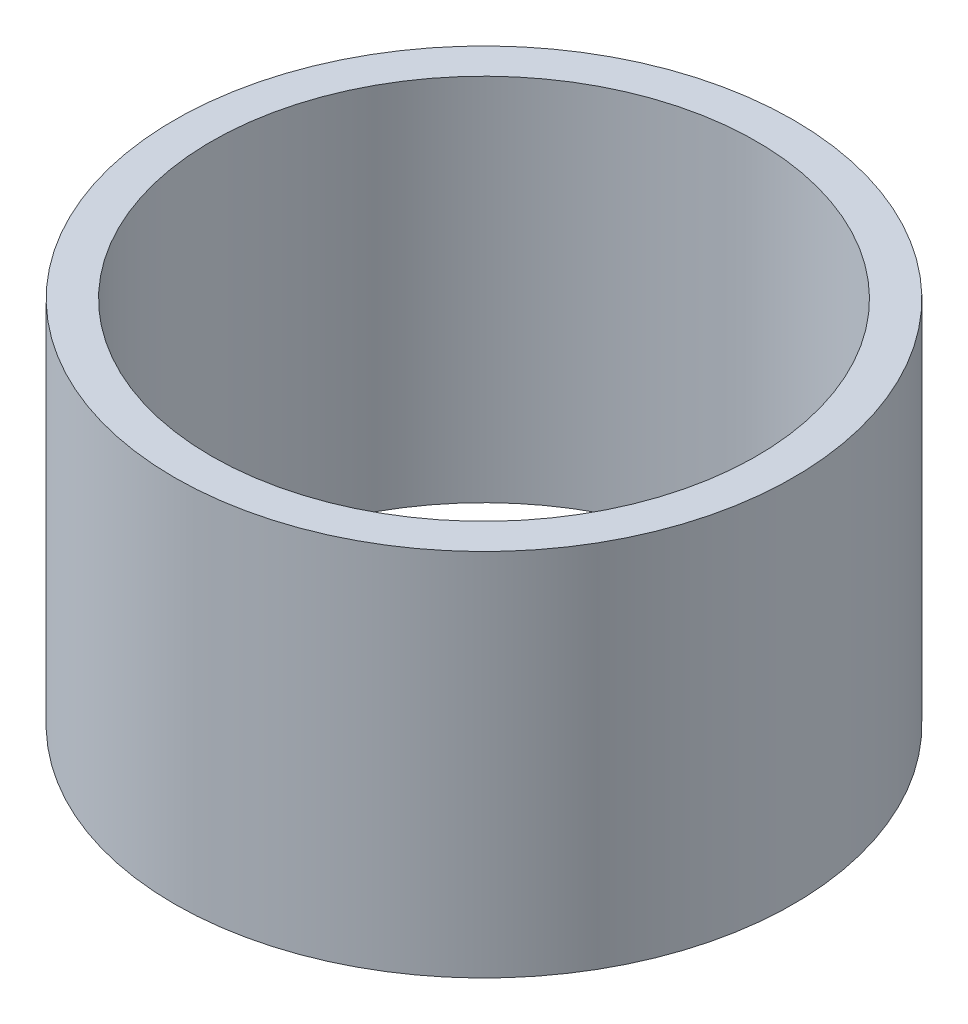
ISO-10303-21;
HEADER;
FILE_DESCRIPTION(('STEP AP214'),'2;1');
FILE_NAME('part.step','',(''),(''),'','','');
FILE_SCHEMA(('AUTOMOTIVE_DESIGN { 1 0 10303 214 1 1 1 1 }'));
ENDSEC;
DATA;
#1=APPLICATION_CONTEXT('core data for automotive mechanical design processes');
#2=APPLICATION_PROTOCOL_DEFINITION('international standard','automotive_design',2000,#1);
#3=PRODUCT_CONTEXT('',#1,'mechanical');
#4=PRODUCT('Part','Part','',(#3));
#5=PRODUCT_RELATED_PRODUCT_CATEGORY('part','',(#4));
#6=PRODUCT_DEFINITION_FORMATION('','',#4);
#7=PRODUCT_DEFINITION_CONTEXT('part definition',#1,'design');
#8=PRODUCT_DEFINITION('design','',#6,#7);
#9=PRODUCT_DEFINITION_SHAPE('','',#8);
#10=(LENGTH_UNIT() NAMED_UNIT(*) SI_UNIT(.MILLI.,.METRE.));
#11=(NAMED_UNIT(*) PLANE_ANGLE_UNIT() SI_UNIT($,.RADIAN.));
#12=(NAMED_UNIT(*) SI_UNIT($,.STERADIAN.) SOLID_ANGLE_UNIT());
#13=UNCERTAINTY_MEASURE_WITH_UNIT(LENGTH_MEASURE(1.E-05),#10,'distance_accuracy_value','');
#14=(GEOMETRIC_REPRESENTATION_CONTEXT(3) GLOBAL_UNCERTAINTY_ASSIGNED_CONTEXT((#13)) GLOBAL_UNIT_ASSIGNED_CONTEXT((#10,
#11,#12)) REPRESENTATION_CONTEXT('',''));
#15=CARTESIAN_POINT('',(0.,0.,0.));
#16=DIRECTION('',(0.,0.,1.));
#17=DIRECTION('',(1.,0.,0.));
#18=AXIS2_PLACEMENT_3D('',#15,#16,#17);
#19=CARTESIAN_POINT('',(0.,65.6178464032688,0.));
#20=DIRECTION('',(0.,-1.,0.));
#21=DIRECTION('',(0.,0.,-1.));
#22=AXIS2_PLACEMENT_3D('',#19,#20,#21);
#23=CYLINDRICAL_SURFACE('',#22,55.);
#24=CARTESIAN_POINT('',(0.,65.6178464032688,0.));
#25=DIRECTION('',(0.,1.,0.));
#26=DIRECTION('',(0.,0.,1.));
#27=AXIS2_PLACEMENT_3D('',#24,#25,#26);
#28=CIRCLE('',#27,55.);
#29=CARTESIAN_POINT('',(0.,65.6178464032688,55.));
#30=VERTEX_POINT('',#29);
#31=EDGE_CURVE('E10',#30,#30,#28,.T.);
#32=ORIENTED_EDGE('',*,*,#31,.F.);
#33=EDGE_LOOP('',(#32));
#34=FACE_BOUND('',#33,.T.);
#35=CARTESIAN_POINT('',(0.,0.,0.));
#36=DIRECTION('',(0.,1.,0.));
#37=DIRECTION('',(0.,0.,1.));
#38=AXIS2_PLACEMENT_3D('',#35,#36,#37);
#39=CIRCLE('',#38,55.);
#40=CARTESIAN_POINT('',(0.,0.,55.));
#41=VERTEX_POINT('',#40);
#42=EDGE_CURVE('E37',#41,#41,#39,.T.);
#43=ORIENTED_EDGE('',*,*,#42,.T.);
#44=EDGE_LOOP('',(#43));
#45=FACE_BOUND('',#44,.T.);
#46=ADVANCED_FACE('F40',(#34,#45),#23,.T.);
#47=CARTESIAN_POINT('',(0.,65.6178464032688,0.));
#48=DIRECTION('',(0.,1.,0.));
#49=DIRECTION('',(0.,0.,1.));
#50=AXIS2_PLACEMENT_3D('',#47,#48,#49);
#51=PLANE('',#50);
#52=CARTESIAN_POINT('',(0.,65.6178464032688,0.));
#53=DIRECTION('',(0.,1.,0.));
#54=DIRECTION('',(0.,0.,1.));
#55=AXIS2_PLACEMENT_3D('',#52,#53,#54);
#56=CIRCLE('',#55,48.4254078750892);
#57=CARTESIAN_POINT('',(0.,65.6178464032688,48.4254078750892));
#58=VERTEX_POINT('',#57);
#59=EDGE_CURVE('E50',#58,#58,#56,.T.);
#60=ORIENTED_EDGE('',*,*,#59,.F.);
#61=EDGE_LOOP('',(#60));
#62=FACE_BOUND('',#61,.T.);
#63=ORIENTED_EDGE('',*,*,#31,.T.);
#64=EDGE_LOOP('',(#63));
#65=FACE_BOUND('',#64,.T.);
#66=ADVANCED_FACE('F59',(#62,#65),#51,.T.);
#67=CARTESIAN_POINT('',(0.,0.,0.));
#68=DIRECTION('',(0.,1.,0.));
#69=DIRECTION('',(0.,0.,1.));
#70=AXIS2_PLACEMENT_3D('',#67,#68,#69);
#71=PLANE('',#70);
#72=CARTESIAN_POINT('',(0.,0.,0.));
#73=DIRECTION('',(0.,1.,0.));
#74=DIRECTION('',(0.,0.,1.));
#75=AXIS2_PLACEMENT_3D('',#72,#73,#74);
#76=CIRCLE('',#75,48.4254078750892);
#77=CARTESIAN_POINT('',(0.,0.,48.4254078750892));
#78=VERTEX_POINT('',#77);
#79=EDGE_CURVE('E47',#78,#78,#76,.T.);
#80=ORIENTED_EDGE('',*,*,#79,.T.);
#81=EDGE_LOOP('',(#80));
#82=FACE_BOUND('',#81,.T.);
#83=ORIENTED_EDGE('',*,*,#42,.F.);
#84=EDGE_LOOP('',(#83));
#85=FACE_BOUND('',#84,.T.);
#86=ADVANCED_FACE('F58',(#82,#85),#71,.F.);
#87=CARTESIAN_POINT('',(0.,65.6178464032688,0.));
#88=DIRECTION('',(0.,-1.,0.));
#89=DIRECTION('',(0.,0.,-1.));
#90=AXIS2_PLACEMENT_3D('',#87,#88,#89);
#91=CYLINDRICAL_SURFACE('',#90,48.4254078750892);
#92=ORIENTED_EDGE('',*,*,#59,.T.);
#93=EDGE_LOOP('',(#92));
#94=FACE_BOUND('',#93,.T.);
#95=ORIENTED_EDGE('',*,*,#79,.F.);
#96=EDGE_LOOP('',(#95));
#97=FACE_BOUND('',#96,.T.);
#98=ADVANCED_FACE('F54',(#94,#97),#91,.F.);
#99=CLOSED_SHELL('',(#46,#66,#86,#98));
#100=MANIFOLD_SOLID_BREP('B2',#99);
#101=ADVANCED_BREP_SHAPE_REPRESENTATION('',(#18,#100),#14);
#102=SHAPE_DEFINITION_REPRESENTATION(#9,#101);
ENDSEC;
END-ISO-10303-21;
